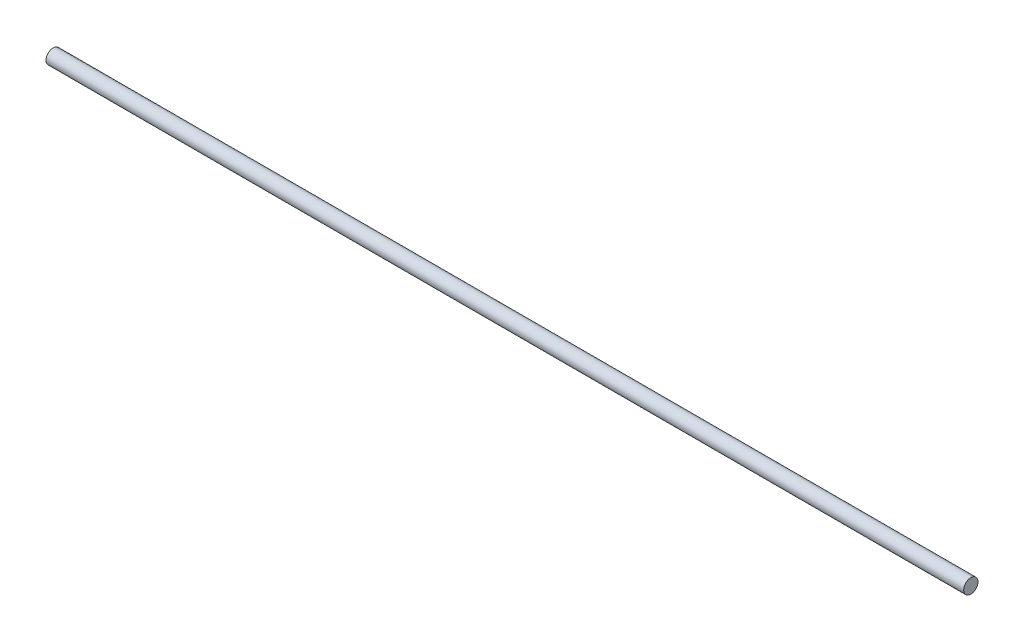
ISO-10303-21;
HEADER;
FILE_DESCRIPTION(('STEP AP214'),'2;1');
FILE_NAME('part.step','',(''),(''),'','','');
FILE_SCHEMA(('AUTOMOTIVE_DESIGN { 1 0 10303 214 1 1 1 1 }'));
ENDSEC;
DATA;
#1=APPLICATION_CONTEXT('core data for automotive mechanical design processes');
#2=APPLICATION_PROTOCOL_DEFINITION('international standard','automotive_design',2000,#1);
#3=PRODUCT_CONTEXT('',#1,'mechanical');
#4=PRODUCT('Part','Part','',(#3));
#5=PRODUCT_RELATED_PRODUCT_CATEGORY('part','',(#4));
#6=PRODUCT_DEFINITION_FORMATION('','',#4);
#7=PRODUCT_DEFINITION_CONTEXT('part definition',#1,'design');
#8=PRODUCT_DEFINITION('design','',#6,#7);
#9=PRODUCT_DEFINITION_SHAPE('','',#8);
#10=(LENGTH_UNIT() NAMED_UNIT(*) SI_UNIT(.MILLI.,.METRE.));
#11=(NAMED_UNIT(*) PLANE_ANGLE_UNIT() SI_UNIT($,.RADIAN.));
#12=(NAMED_UNIT(*) SI_UNIT($,.STERADIAN.) SOLID_ANGLE_UNIT());
#13=UNCERTAINTY_MEASURE_WITH_UNIT(LENGTH_MEASURE(1.E-05),#10,'distance_accuracy_value','');
#14=(GEOMETRIC_REPRESENTATION_CONTEXT(3) GLOBAL_UNCERTAINTY_ASSIGNED_CONTEXT((#13)) GLOBAL_UNIT_ASSIGNED_CONTEXT((#10,
#11,#12)) REPRESENTATION_CONTEXT('',''));
#15=CARTESIAN_POINT('',(0.,0.,0.));
#16=DIRECTION('',(0.,0.,1.));
#17=DIRECTION('',(1.,0.,0.));
#18=AXIS2_PLACEMENT_3D('',#15,#16,#17);
#19=CARTESIAN_POINT('',(406.4,0.,0.));
#20=DIRECTION('',(-1.,0.,0.));
#21=DIRECTION('',(0.,0.,1.));
#22=AXIS2_PLACEMENT_3D('',#19,#20,#21);
#23=CYLINDRICAL_SURFACE('',#22,3.175);
#24=CARTESIAN_POINT('',(406.4,0.,0.));
#25=DIRECTION('',(1.,0.,0.));
#26=DIRECTION('',(0.,0.,-1.));
#27=AXIS2_PLACEMENT_3D('',#24,#25,#26);
#28=CIRCLE('',#27,3.175);
#29=CARTESIAN_POINT('',(406.4,0.,-3.175));
#30=VERTEX_POINT('',#29);
#31=EDGE_CURVE('E10',#30,#30,#28,.T.);
#32=ORIENTED_EDGE('',*,*,#31,.F.);
#33=EDGE_LOOP('',(#32));
#34=FACE_BOUND('',#33,.T.);
#35=CARTESIAN_POINT('',(0.,0.,0.));
#36=DIRECTION('',(1.,0.,0.));
#37=DIRECTION('',(0.,0.,-1.));
#38=AXIS2_PLACEMENT_3D('',#35,#36,#37);
#39=CIRCLE('',#38,3.175);
#40=CARTESIAN_POINT('',(0.,0.,-3.175));
#41=VERTEX_POINT('',#40);
#42=EDGE_CURVE('E40',#41,#41,#39,.T.);
#43=ORIENTED_EDGE('',*,*,#42,.T.);
#44=EDGE_LOOP('',(#43));
#45=FACE_BOUND('',#44,.T.);
#46=ADVANCED_FACE('F37',(#34,#45),#23,.T.);
#47=CARTESIAN_POINT('',(406.4,0.,0.));
#48=DIRECTION('',(1.,0.,0.));
#49=DIRECTION('',(0.,0.,-1.));
#50=AXIS2_PLACEMENT_3D('',#47,#48,#49);
#51=PLANE('',#50);
#52=ORIENTED_EDGE('',*,*,#31,.T.);
#53=EDGE_LOOP('',(#52));
#54=FACE_BOUND('',#53,.T.);
#55=ADVANCED_FACE('F54',(#54),#51,.T.);
#56=CARTESIAN_POINT('',(0.,0.,0.));
#57=DIRECTION('',(1.,0.,0.));
#58=DIRECTION('',(0.,0.,-1.));
#59=AXIS2_PLACEMENT_3D('',#56,#57,#58);
#60=PLANE('',#59);
#61=ORIENTED_EDGE('',*,*,#42,.F.);
#62=EDGE_LOOP('',(#61));
#63=FACE_BOUND('',#62,.T.);
#64=ADVANCED_FACE('F52',(#63),#60,.F.);
#65=CLOSED_SHELL('',(#46,#55,#64));
#66=MANIFOLD_SOLID_BREP('B2',#65);
#67=ADVANCED_BREP_SHAPE_REPRESENTATION('',(#18,#66),#14);
#68=SHAPE_DEFINITION_REPRESENTATION(#9,#67);
ENDSEC;
END-ISO-10303-21;
